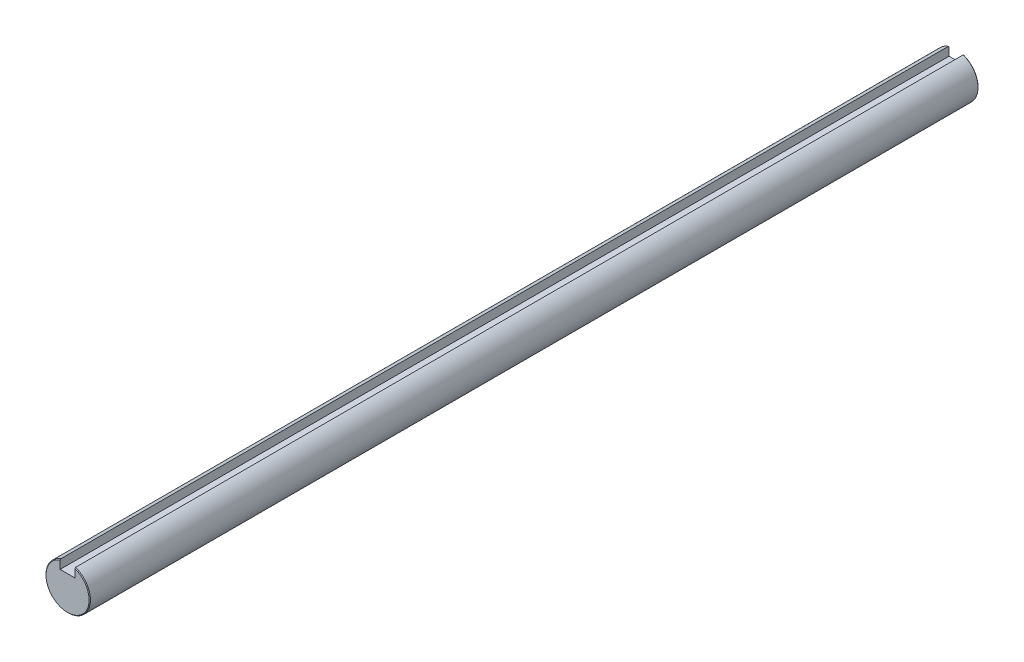
ISO-10303-21;
HEADER;
FILE_DESCRIPTION(('STEP AP214'),'2;1');
FILE_NAME('part.step','',(''),(''),'','','');
FILE_SCHEMA(('AUTOMOTIVE_DESIGN { 1 0 10303 214 1 1 1 1 }'));
ENDSEC;
DATA;
#1=APPLICATION_CONTEXT('core data for automotive mechanical design processes');
#2=APPLICATION_PROTOCOL_DEFINITION('international standard','automotive_design',2000,#1);
#3=PRODUCT_CONTEXT('',#1,'mechanical');
#4=PRODUCT('Part','Part','',(#3));
#5=PRODUCT_RELATED_PRODUCT_CATEGORY('part','',(#4));
#6=PRODUCT_DEFINITION_FORMATION('','',#4);
#7=PRODUCT_DEFINITION_CONTEXT('part definition',#1,'design');
#8=PRODUCT_DEFINITION('design','',#6,#7);
#9=PRODUCT_DEFINITION_SHAPE('','',#8);
#10=(LENGTH_UNIT() NAMED_UNIT(*) SI_UNIT(.MILLI.,.METRE.));
#11=(NAMED_UNIT(*) PLANE_ANGLE_UNIT() SI_UNIT($,.RADIAN.));
#12=(NAMED_UNIT(*) SI_UNIT($,.STERADIAN.) SOLID_ANGLE_UNIT());
#13=UNCERTAINTY_MEASURE_WITH_UNIT(LENGTH_MEASURE(1.E-05),#10,'distance_accuracy_value','');
#14=(GEOMETRIC_REPRESENTATION_CONTEXT(3) GLOBAL_UNCERTAINTY_ASSIGNED_CONTEXT((#13)) GLOBAL_UNIT_ASSIGNED_CONTEXT((#10,
#11,#12)) REPRESENTATION_CONTEXT('',''));
#15=CARTESIAN_POINT('',(0.,0.,0.));
#16=DIRECTION('',(0.,0.,1.));
#17=DIRECTION('',(1.,0.,0.));
#18=AXIS2_PLACEMENT_3D('',#15,#16,#17);
#19=CARTESIAN_POINT('',(0.,0.,150.));
#20=DIRECTION('',(0.,0.,-1.));
#21=DIRECTION('',(-1.,0.,0.));
#22=AXIS2_PLACEMENT_3D('',#19,#20,#21);
#23=CYLINDRICAL_SURFACE('',#22,7.5);
#24=DIRECTION('',(0.,0.,-1.));
#25=VECTOR('',#24,1.);
#26=CARTESIAN_POINT('',(-2.5,7.07106781186548,150.));
#27=LINE('',#26,#25);
#28=CARTESIAN_POINT('',(-2.5,7.07106781186548,149.775));
#29=VERTEX_POINT('',#28);
#30=CARTESIAN_POINT('',(-2.5,7.07106781186548,-149.775));
#31=VERTEX_POINT('',#30);
#32=EDGE_CURVE('E135',#29,#31,#27,.T.);
#33=ORIENTED_EDGE('',*,*,#32,.T.);
#34=CARTESIAN_POINT('',(0.,0.,-149.775));
#35=DIRECTION('',(0.,0.,1.));
#36=DIRECTION('',(1.,0.,0.));
#37=AXIS2_PLACEMENT_3D('',#34,#35,#36);
#38=CIRCLE('',#37,7.5);
#39=CARTESIAN_POINT('',(2.5,7.07106781186548,-149.775));
#40=VERTEX_POINT('',#39);
#41=EDGE_CURVE('E146',#31,#40,#38,.T.);
#42=ORIENTED_EDGE('',*,*,#41,.T.);
#43=DIRECTION('',(0.,0.,-1.));
#44=VECTOR('',#43,1.);
#45=CARTESIAN_POINT('',(2.5,7.07106781186548,150.));
#46=LINE('',#45,#44);
#47=CARTESIAN_POINT('',(2.5,7.07106781186548,149.775));
#48=VERTEX_POINT('',#47);
#49=EDGE_CURVE('E117',#48,#40,#46,.T.);
#50=ORIENTED_EDGE('',*,*,#49,.F.);
#51=CARTESIAN_POINT('',(0.,0.,149.775));
#52=DIRECTION('',(0.,0.,1.));
#53=DIRECTION('',(1.,0.,0.));
#54=AXIS2_PLACEMENT_3D('',#51,#52,#53);
#55=CIRCLE('',#54,7.5);
#56=EDGE_CURVE('E143',#48,#29,#55,.F.);
#57=ORIENTED_EDGE('',*,*,#56,.T.);
#58=EDGE_LOOP('',(#33,#42,#50,#57));
#59=FACE_BOUND('',#58,.T.);
#60=ADVANCED_FACE('F41',(#59),#23,.T.);
#61=CARTESIAN_POINT('',(2.5,4.07106781186548,150.));
#62=DIRECTION('',(1.,0.,0.));
#63=DIRECTION('',(0.,0.,-1.));
#64=AXIS2_PLACEMENT_3D('',#61,#62,#63);
#65=PLANE('',#64);
#66=ORIENTED_EDGE('',*,*,#49,.T.);
#67=CARTESIAN_POINT('',(2.5,7.07106781186548,-149.775));
#68=CARTESIAN_POINT('',(2.5,7.03125274169571,-149.812539183695));
#69=CARTESIAN_POINT('',(2.5,6.99141923586524,-149.850058775474));
#70=CARTESIAN_POINT('',(2.5,6.91171535258951,-149.925058775475));
#71=CARTESIAN_POINT('',(2.5,6.87184497514398,-149.962539183696));
#72=CARTESIAN_POINT('',(2.5,6.83195616203746,-150.));
#73=B_SPLINE_CURVE_WITH_KNOTS('',3,(#67,#68,#69,#70,#71,#72),.UNSPECIFIED.,.F.,.F.,(4,2,4),(0.,
0.164164099564815,0.328328200338079),.UNSPECIFIED.);
#74=CARTESIAN_POINT('',(2.5,6.83195616203746,-150.));
#75=VERTEX_POINT('',#74);
#76=EDGE_CURVE('E106',#40,#75,#73,.T.);
#77=ORIENTED_EDGE('',*,*,#76,.T.);
#78=DIRECTION('',(0.,-1.,0.));
#79=VECTOR('',#78,1.);
#80=CARTESIAN_POINT('',(2.5,4.07106781186548,-150.));
#81=LINE('',#80,#79);
#82=CARTESIAN_POINT('',(2.5,4.07106781186548,-150.));
#83=VERTEX_POINT('',#82);
#84=EDGE_CURVE('E99',#75,#83,#81,.T.);
#85=ORIENTED_EDGE('',*,*,#84,.T.);
#86=DIRECTION('',(0.,0.,-1.));
#87=VECTOR('',#86,1.);
#88=CARTESIAN_POINT('',(2.5,4.07106781186548,150.));
#89=LINE('',#88,#87);
#90=CARTESIAN_POINT('',(2.5,4.07106781186548,150.));
#91=VERTEX_POINT('',#90);
#92=EDGE_CURVE('E104',#91,#83,#89,.T.);
#93=ORIENTED_EDGE('',*,*,#92,.F.);
#94=DIRECTION('',(0.,-1.,0.));
#95=VECTOR('',#94,1.);
#96=CARTESIAN_POINT('',(2.5,4.07106781186548,150.));
#97=LINE('',#96,#95);
#98=CARTESIAN_POINT('',(2.5,6.83195616203732,150.));
#99=VERTEX_POINT('',#98);
#100=EDGE_CURVE('E125',#99,#91,#97,.T.);
#101=ORIENTED_EDGE('',*,*,#100,.F.);
#102=CARTESIAN_POINT('',(2.5,6.83195616203732,150.));
#103=CARTESIAN_POINT('',(2.5,6.87184497514386,149.962539183696));
#104=CARTESIAN_POINT('',(2.5,6.91171535258941,149.925058775474));
#105=CARTESIAN_POINT('',(2.5,6.99141923586519,149.850058775474));
#106=CARTESIAN_POINT('',(2.5,7.03125274169569,149.812539183695));
#107=CARTESIAN_POINT('',(2.5,7.07106781186547,149.775));
#108=B_SPLINE_CURVE_WITH_KNOTS('',3,(#102,#103,#104,#105,#106,#107),.UNSPECIFIED.,.F.,.F.,(4,2,
4),(0.,0.164164100773356,0.328328200338258),.UNSPECIFIED.);
#109=EDGE_CURVE('E150',#99,#48,#108,.T.);
#110=ORIENTED_EDGE('',*,*,#109,.T.);
#111=EDGE_LOOP('',(#66,#77,#85,#93,#101,#110));
#112=FACE_BOUND('',#111,.T.);
#113=ADVANCED_FACE('F102',(#112),#65,.F.);
#114=CARTESIAN_POINT('',(2.5,4.07106781186548,150.));
#115=DIRECTION('',(0.,-1.,0.));
#116=DIRECTION('',(1.,0.,0.));
#117=AXIS2_PLACEMENT_3D('',#114,#115,#116);
#118=PLANE('',#117);
#119=ORIENTED_EDGE('',*,*,#92,.T.);
#120=DIRECTION('',(-1.,0.,0.));
#121=VECTOR('',#120,1.);
#122=CARTESIAN_POINT('',(2.5,4.07106781186548,-150.));
#123=LINE('',#122,#121);
#124=CARTESIAN_POINT('',(-2.5,4.07106781186548,-150.));
#125=VERTEX_POINT('',#124);
#126=EDGE_CURVE('E109',#83,#125,#123,.T.);
#127=ORIENTED_EDGE('',*,*,#126,.T.);
#128=DIRECTION('',(0.,0.,-1.));
#129=VECTOR('',#128,1.);
#130=CARTESIAN_POINT('',(-2.5,4.07106781186548,150.));
#131=LINE('',#130,#129);
#132=CARTESIAN_POINT('',(-2.5,4.07106781186548,150.));
#133=VERTEX_POINT('',#132);
#134=EDGE_CURVE('E118',#133,#125,#131,.T.);
#135=ORIENTED_EDGE('',*,*,#134,.F.);
#136=DIRECTION('',(-1.,0.,0.));
#137=VECTOR('',#136,1.);
#138=CARTESIAN_POINT('',(2.5,4.07106781186548,150.));
#139=LINE('',#138,#137);
#140=EDGE_CURVE('E115',#91,#133,#139,.T.);
#141=ORIENTED_EDGE('',*,*,#140,.F.);
#142=EDGE_LOOP('',(#119,#127,#135,#141));
#143=FACE_BOUND('',#142,.T.);
#144=ADVANCED_FACE('F113',(#143),#118,.F.);
#145=CARTESIAN_POINT('',(-2.5,4.07106781186548,150.));
#146=DIRECTION('',(-1.,0.,0.));
#147=DIRECTION('',(0.,0.,1.));
#148=AXIS2_PLACEMENT_3D('',#145,#146,#147);
#149=PLANE('',#148);
#150=DIRECTION('',(0.,1.,0.));
#151=VECTOR('',#150,1.);
#152=CARTESIAN_POINT('',(-2.5,4.07106781186548,-150.));
#153=LINE('',#152,#151);
#154=CARTESIAN_POINT('',(-2.5,6.83195616203746,-150.));
#155=VERTEX_POINT('',#154);
#156=EDGE_CURVE('E121',#125,#155,#153,.T.);
#157=ORIENTED_EDGE('',*,*,#156,.T.);
#158=CARTESIAN_POINT('',(-2.5,6.83195616203746,-150.));
#159=CARTESIAN_POINT('',(-2.5,6.87184497514398,-149.962539183696));
#160=CARTESIAN_POINT('',(-2.5,6.91171535258951,-149.925058775475));
#161=CARTESIAN_POINT('',(-2.5,6.99141923586524,-149.850058775474));
#162=CARTESIAN_POINT('',(-2.5,7.03125274169571,-149.812539183695));
#163=CARTESIAN_POINT('',(-2.5,7.07106781186547,-149.775));
#164=B_SPLINE_CURVE_WITH_KNOTS('',3,(#158,#159,#160,#161,#162,#163),.UNSPECIFIED.,.F.,.F.,(4,2,
4),(0.,0.164164100773264,0.328328200338075),.UNSPECIFIED.);
#165=EDGE_CURVE('E51',#155,#31,#164,.T.);
#166=ORIENTED_EDGE('',*,*,#165,.T.);
#167=ORIENTED_EDGE('',*,*,#32,.F.);
#168=CARTESIAN_POINT('',(-2.5,7.07106781186547,149.775));
#169=CARTESIAN_POINT('',(-2.5,7.03125274169569,149.812539183695));
#170=CARTESIAN_POINT('',(-2.5,6.99141923586519,149.850058775474));
#171=CARTESIAN_POINT('',(-2.5,6.91171535258941,149.925058775474));
#172=CARTESIAN_POINT('',(-2.5,6.87184497514386,149.962539183696));
#173=CARTESIAN_POINT('',(-2.5,6.83195616203732,150.));
#174=B_SPLINE_CURVE_WITH_KNOTS('',3,(#168,#169,#170,#171,#172,#173),.UNSPECIFIED.,.F.,.F.,(4,2,
4),(0.,0.164164099564906,0.328328200338261),.UNSPECIFIED.);
#175=CARTESIAN_POINT('',(-2.5,6.83195616203732,150.));
#176=VERTEX_POINT('',#175);
#177=EDGE_CURVE('E58',#29,#176,#174,.T.);
#178=ORIENTED_EDGE('',*,*,#177,.T.);
#179=DIRECTION('',(0.,1.,0.));
#180=VECTOR('',#179,1.);
#181=CARTESIAN_POINT('',(-2.5,4.07106781186548,150.));
#182=LINE('',#181,#180);
#183=EDGE_CURVE('E132',#133,#176,#182,.T.);
#184=ORIENTED_EDGE('',*,*,#183,.F.);
#185=ORIENTED_EDGE('',*,*,#134,.T.);
#186=EDGE_LOOP('',(#157,#166,#167,#178,#184,#185));
#187=FACE_BOUND('',#186,.T.);
#188=ADVANCED_FACE('F186',(#187),#149,.F.);
#189=CARTESIAN_POINT('',(0.,0.,150.));
#190=DIRECTION('',(0.,0.,1.));
#191=DIRECTION('',(1.,0.,0.));
#192=AXIS2_PLACEMENT_3D('',#189,#190,#191);
#193=PLANE('',#192);
#194=ORIENTED_EDGE('',*,*,#183,.T.);
#195=CARTESIAN_POINT('',(0.,0.,150.));
#196=DIRECTION('',(0.,0.,1.));
#197=DIRECTION('',(1.,0.,0.));
#198=AXIS2_PLACEMENT_3D('',#195,#196,#197);
#199=CIRCLE('',#198,7.27499999999998);
#200=EDGE_CURVE('E11',#176,#99,#199,.T.);
#201=ORIENTED_EDGE('',*,*,#200,.T.);
#202=ORIENTED_EDGE('',*,*,#100,.T.);
#203=ORIENTED_EDGE('',*,*,#140,.T.);
#204=EDGE_LOOP('',(#194,#201,#202,#203));
#205=FACE_BOUND('',#204,.T.);
#206=ADVANCED_FACE('F190',(#205),#193,.T.);
#207=CARTESIAN_POINT('',(0.,0.,-150.));
#208=DIRECTION('',(0.,0.,1.));
#209=DIRECTION('',(1.,0.,0.));
#210=AXIS2_PLACEMENT_3D('',#207,#208,#209);
#211=PLANE('',#210);
#212=ORIENTED_EDGE('',*,*,#84,.F.);
#213=CARTESIAN_POINT('',(0.,0.,-150.));
#214=DIRECTION('',(0.,0.,1.));
#215=DIRECTION('',(1.,0.,0.));
#216=AXIS2_PLACEMENT_3D('',#213,#214,#215);
#217=CIRCLE('',#216,7.27500000000011);
#218=EDGE_CURVE('E66',#75,#155,#217,.F.);
#219=ORIENTED_EDGE('',*,*,#218,.T.);
#220=ORIENTED_EDGE('',*,*,#156,.F.);
#221=ORIENTED_EDGE('',*,*,#126,.F.);
#222=EDGE_LOOP('',(#212,#219,#220,#221));
#223=FACE_BOUND('',#222,.T.);
#224=ADVANCED_FACE('F120',(#223),#211,.F.);
#225=CARTESIAN_POINT('',(0.,0.,-149.775));
#226=DIRECTION('',(0.,0.,1.));
#227=DIRECTION('',(1.,0.,0.));
#228=AXIS2_PLACEMENT_3D('',#225,#226,#227);
#229=CONICAL_SURFACE('',#228,7.5,0.785398163397373);
#230=ORIENTED_EDGE('',*,*,#165,.F.);
#231=ORIENTED_EDGE('',*,*,#218,.F.);
#232=ORIENTED_EDGE('',*,*,#76,.F.);
#233=ORIENTED_EDGE('',*,*,#41,.F.);
#234=EDGE_LOOP('',(#230,#231,#232,#233));
#235=FACE_BOUND('',#234,.T.);
#236=ADVANCED_FACE('F171',(#235),#229,.T.);
#237=CARTESIAN_POINT('',(0.,0.,150.));
#238=DIRECTION('',(0.,0.,-1.));
#239=DIRECTION('',(-1.,0.,0.));
#240=AXIS2_PLACEMENT_3D('',#237,#238,#239);
#241=CONICAL_SURFACE('',#240,7.27499999999998,0.785398163397431);
#242=ORIENTED_EDGE('',*,*,#177,.F.);
#243=ORIENTED_EDGE('',*,*,#56,.F.);
#244=ORIENTED_EDGE('',*,*,#109,.F.);
#245=ORIENTED_EDGE('',*,*,#200,.F.);
#246=EDGE_LOOP('',(#242,#243,#244,#245));
#247=FACE_BOUND('',#246,.T.);
#248=ADVANCED_FACE('F43',(#247),#241,.T.);
#249=CLOSED_SHELL('',(#60,#113,#144,#188,#206,#224,#236,#248));
#250=MANIFOLD_SOLID_BREP('B2',#249);
#251=ADVANCED_BREP_SHAPE_REPRESENTATION('',(#18,#250),#14);
#252=SHAPE_DEFINITION_REPRESENTATION(#9,#251);
ENDSEC;
END-ISO-10303-21;
